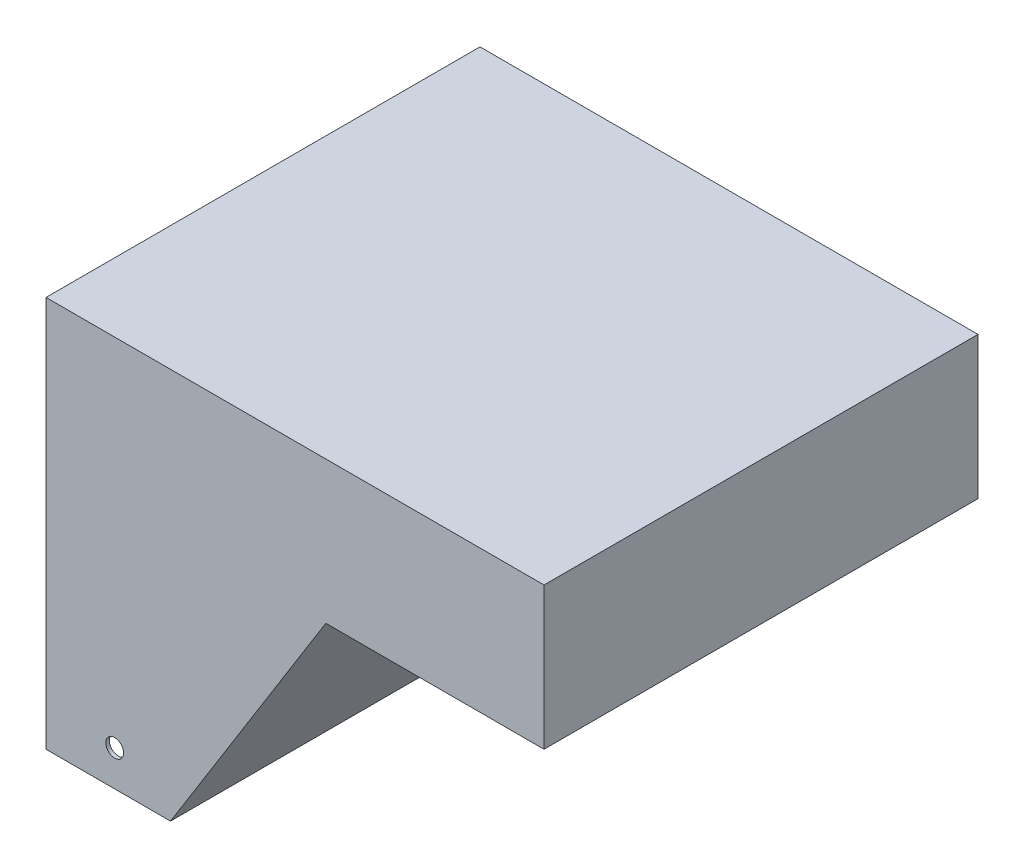
ISO-10303-21;
HEADER;
FILE_DESCRIPTION(('STEP AP214'),'2;1');
FILE_NAME('part.step','',(''),(''),'','','');
FILE_SCHEMA(('AUTOMOTIVE_DESIGN { 1 0 10303 214 1 1 1 1 }'));
ENDSEC;
DATA;
#1=APPLICATION_CONTEXT('core data for automotive mechanical design processes');
#2=APPLICATION_PROTOCOL_DEFINITION('international standard','automotive_design',2000,#1);
#3=PRODUCT_CONTEXT('',#1,'mechanical');
#4=PRODUCT('Part','Part','',(#3));
#5=PRODUCT_RELATED_PRODUCT_CATEGORY('part','',(#4));
#6=PRODUCT_DEFINITION_FORMATION('','',#4);
#7=PRODUCT_DEFINITION_CONTEXT('part definition',#1,'design');
#8=PRODUCT_DEFINITION('design','',#6,#7);
#9=PRODUCT_DEFINITION_SHAPE('','',#8);
#10=(LENGTH_UNIT() NAMED_UNIT(*) SI_UNIT(.MILLI.,.METRE.));
#11=(NAMED_UNIT(*) PLANE_ANGLE_UNIT() SI_UNIT($,.RADIAN.));
#12=(NAMED_UNIT(*) SI_UNIT($,.STERADIAN.) SOLID_ANGLE_UNIT());
#13=UNCERTAINTY_MEASURE_WITH_UNIT(LENGTH_MEASURE(1.E-05),#10,'distance_accuracy_value','');
#14=(GEOMETRIC_REPRESENTATION_CONTEXT(3) GLOBAL_UNCERTAINTY_ASSIGNED_CONTEXT((#13)) GLOBAL_UNIT_ASSIGNED_CONTEXT((#10,
#11,#12)) REPRESENTATION_CONTEXT('',''));
#15=CARTESIAN_POINT('',(0.,0.,0.));
#16=DIRECTION('',(0.,0.,1.));
#17=DIRECTION('',(1.,0.,0.));
#18=AXIS2_PLACEMENT_3D('',#15,#16,#17);
#19=CARTESIAN_POINT('',(0.,0.,2.54));
#20=DIRECTION('',(0.,0.,-1.));
#21=DIRECTION('',(-1.,0.,0.));
#22=AXIS2_PLACEMENT_3D('',#19,#20,#21);
#23=PLANE('',#22);
#24=DIRECTION('',(-1.,0.,0.));
#25=VECTOR('',#24,1.);
#26=CARTESIAN_POINT('',(0.,-2.54,2.54));
#27=LINE('',#26,#25);
#28=CARTESIAN_POINT('',(353.06,-2.54,2.54));
#29=VERTEX_POINT('',#28);
#30=CARTESIAN_POINT('',(2.54,-2.54,2.54));
#31=VERTEX_POINT('',#30);
#32=EDGE_CURVE('E53',#29,#31,#27,.T.);
#33=ORIENTED_EDGE('',*,*,#32,.T.);
#34=DIRECTION('',(0.,-1.,0.));
#35=VECTOR('',#34,1.);
#36=CARTESIAN_POINT('',(2.54,0.,2.54));
#37=LINE('',#36,#35);
#38=CARTESIAN_POINT('',(2.54,-279.4,2.54));
#39=VERTEX_POINT('',#38);
#40=EDGE_CURVE('E172',#31,#39,#37,.T.);
#41=ORIENTED_EDGE('',*,*,#40,.T.);
#42=DIRECTION('',(1.,0.,0.));
#43=VECTOR('',#42,1.);
#44=CARTESIAN_POINT('',(88.9,-279.4,2.54));
#45=LINE('',#44,#43);
#46=CARTESIAN_POINT('',(87.4907516063811,-279.4,2.54));
#47=VERTEX_POINT('',#46);
#48=EDGE_CURVE('E143',#39,#47,#45,.T.);
#49=ORIENTED_EDGE('',*,*,#48,.T.);
#50=DIRECTION('',(0.,-1.,0.));
#51=VECTOR('',#50,1.);
#52=CARTESIAN_POINT('',(87.4907516063811,0.,2.54));
#53=LINE('',#52,#51);
#54=CARTESIAN_POINT('',(87.4907516063811,-276.86,2.54));
#55=VERTEX_POINT('',#54);
#56=EDGE_CURVE('E197',#55,#47,#53,.T.);
#57=ORIENTED_EDGE('',*,*,#56,.F.);
#58=DIRECTION('',(0.529253460986314,0.848463772965003,0.));
#59=VECTOR('',#58,1.);
#60=CARTESIAN_POINT('',(187.30842913698,-116.838971269484,2.54));
#61=LINE('',#60,#59);
#62=CARTESIAN_POINT('',(198.398569195958,-99.06,2.54));
#63=VERTEX_POINT('',#62);
#64=EDGE_CURVE('E194',#55,#63,#61,.T.);
#65=ORIENTED_EDGE('',*,*,#64,.T.);
#66=DIRECTION('',(1.,0.,0.));
#67=VECTOR('',#66,1.);
#68=CARTESIAN_POINT('',(0.,-99.06,2.54));
#69=LINE('',#68,#67);
#70=CARTESIAN_POINT('',(353.06,-99.06,2.54));
#71=VERTEX_POINT('',#70);
#72=EDGE_CURVE('E191',#63,#71,#69,.T.);
#73=ORIENTED_EDGE('',*,*,#72,.T.);
#74=DIRECTION('',(0.,1.,0.));
#75=VECTOR('',#74,1.);
#76=CARTESIAN_POINT('',(353.06,0.,2.54));
#77=LINE('',#76,#75);
#78=EDGE_CURVE('E188',#71,#29,#77,.T.);
#79=ORIENTED_EDGE('',*,*,#78,.T.);
#80=EDGE_LOOP('',(#33,#41,#49,#57,#65,#73,#79));
#81=FACE_BOUND('',#80,.T.);
#82=CARTESIAN_POINT('',(49.0380508143322,-254.,2.54));
#83=DIRECTION('',(0.,0.,1.));
#84=DIRECTION('',(1.,0.,0.));
#85=AXIS2_PLACEMENT_3D('',#82,#83,#84);
#86=CIRCLE('',#85,6.35);
#87=CARTESIAN_POINT('',(55.3880508143322,-254.,2.54));
#88=VERTEX_POINT('',#87);
#89=EDGE_CURVE('E216',#88,#88,#86,.T.);
#90=ORIENTED_EDGE('',*,*,#89,.F.);
#91=EDGE_LOOP('',(#90));
#92=FACE_BOUND('',#91,.T.);
#93=ADVANCED_FACE('F38',(#81,#92),#23,.F.);
#94=CARTESIAN_POINT('',(0.,0.,0.));
#95=DIRECTION('',(0.,0.,-1.));
#96=DIRECTION('',(-1.,0.,0.));
#97=AXIS2_PLACEMENT_3D('',#94,#95,#96);
#98=PLANE('',#97);
#99=DIRECTION('',(0.,-1.,0.));
#100=VECTOR('',#99,1.);
#101=CARTESIAN_POINT('',(0.,-279.4,0.));
#102=LINE('',#101,#100);
#103=CARTESIAN_POINT('',(0.,0.,0.));
#104=VERTEX_POINT('',#103);
#105=CARTESIAN_POINT('',(0.,-279.4,0.));
#106=VERTEX_POINT('',#105);
#107=EDGE_CURVE('E219',#104,#106,#102,.T.);
#108=ORIENTED_EDGE('',*,*,#107,.F.);
#109=DIRECTION('',(-1.,0.,0.));
#110=VECTOR('',#109,1.);
#111=CARTESIAN_POINT('',(0.,0.,0.));
#112=LINE('',#111,#110);
#113=CARTESIAN_POINT('',(355.6,0.,0.));
#114=VERTEX_POINT('',#113);
#115=EDGE_CURVE('E61',#114,#104,#112,.T.);
#116=ORIENTED_EDGE('',*,*,#115,.F.);
#117=DIRECTION('',(0.,1.,0.));
#118=VECTOR('',#117,1.);
#119=CARTESIAN_POINT('',(355.6,0.,0.));
#120=LINE('',#119,#118);
#121=CARTESIAN_POINT('',(355.6,-101.6,0.));
#122=VERTEX_POINT('',#121);
#123=EDGE_CURVE('E231',#122,#114,#120,.T.);
#124=ORIENTED_EDGE('',*,*,#123,.F.);
#125=DIRECTION('',(1.,0.,0.));
#126=VECTOR('',#125,1.);
#127=CARTESIAN_POINT('',(355.6,-101.6,0.));
#128=LINE('',#127,#126);
#129=CARTESIAN_POINT('',(199.807817589577,-101.6,0.));
#130=VERTEX_POINT('',#129);
#131=EDGE_CURVE('E229',#130,#122,#128,.T.);
#132=ORIENTED_EDGE('',*,*,#131,.F.);
#133=DIRECTION('',(0.529253460986314,0.848463772965003,0.));
#134=VECTOR('',#133,1.);
#135=CARTESIAN_POINT('',(199.807817589577,-101.6,0.));
#136=LINE('',#135,#134);
#137=CARTESIAN_POINT('',(88.9,-279.4,0.));
#138=VERTEX_POINT('',#137);
#139=EDGE_CURVE('E227',#138,#130,#136,.T.);
#140=ORIENTED_EDGE('',*,*,#139,.F.);
#141=DIRECTION('',(1.,0.,0.));
#142=VECTOR('',#141,1.);
#143=CARTESIAN_POINT('',(88.9,-279.4,0.));
#144=LINE('',#143,#142);
#145=EDGE_CURVE('E225',#106,#138,#144,.T.);
#146=ORIENTED_EDGE('',*,*,#145,.F.);
#147=EDGE_LOOP('',(#108,#116,#124,#132,#140,#146));
#148=FACE_BOUND('',#147,.T.);
#149=CARTESIAN_POINT('',(49.0380508143322,-254.,0.));
#150=DIRECTION('',(0.,0.,1.));
#151=DIRECTION('',(1.,0.,0.));
#152=AXIS2_PLACEMENT_3D('',#149,#150,#151);
#153=CIRCLE('',#152,6.35);
#154=CARTESIAN_POINT('',(55.3880508143322,-254.,0.));
#155=VERTEX_POINT('',#154);
#156=EDGE_CURVE('E215',#155,#155,#153,.T.);
#157=ORIENTED_EDGE('',*,*,#156,.T.);
#158=EDGE_LOOP('',(#157));
#159=FACE_BOUND('',#158,.T.);
#160=ADVANCED_FACE('F248',(#148,#159),#98,.T.);
#161=CARTESIAN_POINT('',(0.,-279.4,2.54));
#162=DIRECTION('',(1.,0.,0.));
#163=DIRECTION('',(0.,0.,-1.));
#164=AXIS2_PLACEMENT_3D('',#161,#162,#163);
#165=PLANE('',#164);
#166=ORIENTED_EDGE('',*,*,#107,.T.);
#167=DIRECTION('',(0.,0.,-1.));
#168=VECTOR('',#167,1.);
#169=CARTESIAN_POINT('',(0.,-279.4,2.54));
#170=LINE('',#169,#168);
#171=CARTESIAN_POINT('',(0.,-279.4,309.88));
#172=VERTEX_POINT('',#171);
#173=EDGE_CURVE('E11',#172,#106,#170,.T.);
#174=ORIENTED_EDGE('',*,*,#173,.F.);
#175=DIRECTION('',(0.,-1.,0.));
#176=VECTOR('',#175,1.);
#177=CARTESIAN_POINT('',(0.,-279.4,309.88));
#178=LINE('',#177,#176);
#179=CARTESIAN_POINT('',(0.,0.,309.88));
#180=VERTEX_POINT('',#179);
#181=EDGE_CURVE('E146',#180,#172,#178,.T.);
#182=ORIENTED_EDGE('',*,*,#181,.F.);
#183=DIRECTION('',(0.,0.,-1.));
#184=VECTOR('',#183,1.);
#185=CARTESIAN_POINT('',(0.,0.,2.54));
#186=LINE('',#185,#184);
#187=EDGE_CURVE('E133',#180,#104,#186,.T.);
#188=ORIENTED_EDGE('',*,*,#187,.T.);
#189=EDGE_LOOP('',(#166,#174,#182,#188));
#190=FACE_BOUND('',#189,.T.);
#191=ADVANCED_FACE('F40',(#190),#165,.F.);
#192=CARTESIAN_POINT('',(88.9,-279.4,2.54));
#193=DIRECTION('',(0.,1.,0.));
#194=DIRECTION('',(0.,0.,1.));
#195=AXIS2_PLACEMENT_3D('',#192,#193,#194);
#196=PLANE('',#195);
#197=DIRECTION('',(0.,0.,-1.));
#198=VECTOR('',#197,1.);
#199=CARTESIAN_POINT('',(88.9,-279.4,2.54));
#200=LINE('',#199,#198);
#201=CARTESIAN_POINT('',(88.9,-279.4,309.88));
#202=VERTEX_POINT('',#201);
#203=EDGE_CURVE('E46',#202,#138,#200,.T.);
#204=ORIENTED_EDGE('',*,*,#203,.F.);
#205=DIRECTION('',(1.,0.,0.));
#206=VECTOR('',#205,1.);
#207=CARTESIAN_POINT('',(88.9,-279.4,309.88));
#208=LINE('',#207,#206);
#209=EDGE_CURVE('E165',#172,#202,#208,.T.);
#210=ORIENTED_EDGE('',*,*,#209,.F.);
#211=ORIENTED_EDGE('',*,*,#173,.T.);
#212=ORIENTED_EDGE('',*,*,#145,.T.);
#213=EDGE_LOOP('',(#204,#210,#211,#212));
#214=FACE_BOUND('',#213,.T.);
#215=DIRECTION('',(1.,0.,0.));
#216=VECTOR('',#215,1.);
#217=CARTESIAN_POINT('',(88.9,-279.4,307.34));
#218=LINE('',#217,#216);
#219=CARTESIAN_POINT('',(2.54,-279.4,307.34));
#220=VERTEX_POINT('',#219);
#221=CARTESIAN_POINT('',(87.4907516063811,-279.4,307.34));
#222=VERTEX_POINT('',#221);
#223=EDGE_CURVE('E167',#220,#222,#218,.T.);
#224=ORIENTED_EDGE('',*,*,#223,.T.);
#225=DIRECTION('',(0.,0.,-1.));
#226=VECTOR('',#225,1.);
#227=CARTESIAN_POINT('',(87.4907516063811,-279.4,307.34));
#228=LINE('',#227,#226);
#229=EDGE_CURVE('E204',#222,#47,#228,.T.);
#230=ORIENTED_EDGE('',*,*,#229,.T.);
#231=ORIENTED_EDGE('',*,*,#48,.F.);
#232=DIRECTION('',(0.,0.,-1.));
#233=VECTOR('',#232,1.);
#234=CARTESIAN_POINT('',(2.54,-279.4,307.34));
#235=LINE('',#234,#233);
#236=EDGE_CURVE('E202',#220,#39,#235,.T.);
#237=ORIENTED_EDGE('',*,*,#236,.F.);
#238=EDGE_LOOP('',(#224,#230,#231,#237));
#239=FACE_BOUND('',#238,.T.);
#240=ADVANCED_FACE('F256',(#214,#239),#196,.F.);
#241=CARTESIAN_POINT('',(199.807817589577,-101.6,2.54));
#242=DIRECTION('',(-0.848463772965003,0.529253460986314,0.));
#243=DIRECTION('',(-0.529253460986314,-0.848463772965003,0.));
#244=AXIS2_PLACEMENT_3D('',#241,#242,#243);
#245=PLANE('',#244);
#246=ORIENTED_EDGE('',*,*,#139,.T.);
#247=DIRECTION('',(0.,0.,-1.));
#248=VECTOR('',#247,1.);
#249=CARTESIAN_POINT('',(199.807817589577,-101.6,2.54));
#250=LINE('',#249,#248);
#251=CARTESIAN_POINT('',(199.807817589577,-101.6,309.88));
#252=VERTEX_POINT('',#251);
#253=EDGE_CURVE('E238',#252,#130,#250,.T.);
#254=ORIENTED_EDGE('',*,*,#253,.F.);
#255=DIRECTION('',(0.529253460986314,0.848463772965003,0.));
#256=VECTOR('',#255,1.);
#257=CARTESIAN_POINT('',(199.807817589577,-101.6,309.88));
#258=LINE('',#257,#256);
#259=EDGE_CURVE('E162',#202,#252,#258,.T.);
#260=ORIENTED_EDGE('',*,*,#259,.F.);
#261=ORIENTED_EDGE('',*,*,#203,.T.);
#262=EDGE_LOOP('',(#246,#254,#260,#261));
#263=FACE_BOUND('',#262,.T.);
#264=ADVANCED_FACE('F244',(#263),#245,.F.);
#265=CARTESIAN_POINT('',(355.6,-101.6,2.54));
#266=DIRECTION('',(0.,1.,0.));
#267=DIRECTION('',(0.,0.,1.));
#268=AXIS2_PLACEMENT_3D('',#265,#266,#267);
#269=PLANE('',#268);
#270=ORIENTED_EDGE('',*,*,#131,.T.);
#271=DIRECTION('',(0.,0.,-1.));
#272=VECTOR('',#271,1.);
#273=CARTESIAN_POINT('',(355.6,-101.6,2.54));
#274=LINE('',#273,#272);
#275=CARTESIAN_POINT('',(355.6,-101.6,309.88));
#276=VERTEX_POINT('',#275);
#277=EDGE_CURVE('E235',#276,#122,#274,.T.);
#278=ORIENTED_EDGE('',*,*,#277,.F.);
#279=DIRECTION('',(1.,0.,0.));
#280=VECTOR('',#279,1.);
#281=CARTESIAN_POINT('',(355.6,-101.6,309.88));
#282=LINE('',#281,#280);
#283=EDGE_CURVE('E157',#252,#276,#282,.T.);
#284=ORIENTED_EDGE('',*,*,#283,.F.);
#285=ORIENTED_EDGE('',*,*,#253,.T.);
#286=EDGE_LOOP('',(#270,#278,#284,#285));
#287=FACE_BOUND('',#286,.T.);
#288=ADVANCED_FACE('F252',(#287),#269,.F.);
#289=CARTESIAN_POINT('',(355.6,0.,2.54));
#290=DIRECTION('',(-1.,0.,0.));
#291=DIRECTION('',(0.,0.,1.));
#292=AXIS2_PLACEMENT_3D('',#289,#290,#291);
#293=PLANE('',#292);
#294=ORIENTED_EDGE('',*,*,#123,.T.);
#295=DIRECTION('',(0.,0.,-1.));
#296=VECTOR('',#295,1.);
#297=CARTESIAN_POINT('',(355.6,0.,2.54));
#298=LINE('',#297,#296);
#299=CARTESIAN_POINT('',(355.6,0.,309.88));
#300=VERTEX_POINT('',#299);
#301=EDGE_CURVE('E142',#300,#114,#298,.T.);
#302=ORIENTED_EDGE('',*,*,#301,.F.);
#303=DIRECTION('',(0.,1.,0.));
#304=VECTOR('',#303,1.);
#305=CARTESIAN_POINT('',(355.6,0.,309.88));
#306=LINE('',#305,#304);
#307=EDGE_CURVE('E155',#276,#300,#306,.T.);
#308=ORIENTED_EDGE('',*,*,#307,.F.);
#309=ORIENTED_EDGE('',*,*,#277,.T.);
#310=EDGE_LOOP('',(#294,#302,#308,#309));
#311=FACE_BOUND('',#310,.T.);
#312=ADVANCED_FACE('F255',(#311),#293,.F.);
#313=CARTESIAN_POINT('',(0.,0.,2.54));
#314=DIRECTION('',(0.,-1.,0.));
#315=DIRECTION('',(0.,0.,-1.));
#316=AXIS2_PLACEMENT_3D('',#313,#314,#315);
#317=PLANE('',#316);
#318=ORIENTED_EDGE('',*,*,#115,.T.);
#319=ORIENTED_EDGE('',*,*,#187,.F.);
#320=DIRECTION('',(-1.,0.,0.));
#321=VECTOR('',#320,1.);
#322=CARTESIAN_POINT('',(0.,0.,309.88));
#323=LINE('',#322,#321);
#324=EDGE_CURVE('E137',#300,#180,#323,.T.);
#325=ORIENTED_EDGE('',*,*,#324,.F.);
#326=ORIENTED_EDGE('',*,*,#301,.T.);
#327=EDGE_LOOP('',(#318,#319,#325,#326));
#328=FACE_BOUND('',#327,.T.);
#329=ADVANCED_FACE('F135',(#328),#317,.F.);
#330=CARTESIAN_POINT('',(49.0380508143322,-254.,2.54));
#331=DIRECTION('',(0.,0.,-1.));
#332=DIRECTION('',(-1.,0.,0.));
#333=AXIS2_PLACEMENT_3D('',#330,#331,#332);
#334=CYLINDRICAL_SURFACE('',#333,6.35);
#335=ORIENTED_EDGE('',*,*,#89,.T.);
#336=EDGE_LOOP('',(#335));
#337=FACE_BOUND('',#336,.T.);
#338=ORIENTED_EDGE('',*,*,#156,.F.);
#339=EDGE_LOOP('',(#338));
#340=FACE_BOUND('',#339,.T.);
#341=ADVANCED_FACE('F303',(#337,#340),#334,.F.);
#342=CARTESIAN_POINT('',(0.,-2.54,307.34));
#343=DIRECTION('',(0.,-1.,0.));
#344=DIRECTION('',(0.,0.,-1.));
#345=AXIS2_PLACEMENT_3D('',#342,#343,#344);
#346=PLANE('',#345);
#347=ORIENTED_EDGE('',*,*,#32,.F.);
#348=DIRECTION('',(0.,0.,-1.));
#349=VECTOR('',#348,1.);
#350=CARTESIAN_POINT('',(353.06,-2.54,307.34));
#351=LINE('',#350,#349);
#352=CARTESIAN_POINT('',(353.06,-2.54,307.34));
#353=VERTEX_POINT('',#352);
#354=EDGE_CURVE('E213',#353,#29,#351,.T.);
#355=ORIENTED_EDGE('',*,*,#354,.F.);
#356=DIRECTION('',(-1.,0.,0.));
#357=VECTOR('',#356,1.);
#358=CARTESIAN_POINT('',(0.,-2.54,307.34));
#359=LINE('',#358,#357);
#360=CARTESIAN_POINT('',(2.54,-2.54,307.34));
#361=VERTEX_POINT('',#360);
#362=EDGE_CURVE('E168',#353,#361,#359,.T.);
#363=ORIENTED_EDGE('',*,*,#362,.T.);
#364=DIRECTION('',(0.,0.,-1.));
#365=VECTOR('',#364,1.);
#366=CARTESIAN_POINT('',(2.54,-2.54,307.34));
#367=LINE('',#366,#365);
#368=EDGE_CURVE('E186',#361,#31,#367,.T.);
#369=ORIENTED_EDGE('',*,*,#368,.T.);
#370=EDGE_LOOP('',(#347,#355,#363,#369));
#371=FACE_BOUND('',#370,.T.);
#372=ADVANCED_FACE('F278',(#371),#346,.T.);
#373=CARTESIAN_POINT('',(353.06,0.,307.34));
#374=DIRECTION('',(-1.,0.,0.));
#375=DIRECTION('',(0.,0.,1.));
#376=AXIS2_PLACEMENT_3D('',#373,#374,#375);
#377=PLANE('',#376);
#378=ORIENTED_EDGE('',*,*,#78,.F.);
#379=DIRECTION('',(0.,0.,-1.));
#380=VECTOR('',#379,1.);
#381=CARTESIAN_POINT('',(353.06,-99.06,307.34));
#382=LINE('',#381,#380);
#383=CARTESIAN_POINT('',(353.06,-99.06,307.34));
#384=VERTEX_POINT('',#383);
#385=EDGE_CURVE('E211',#384,#71,#382,.T.);
#386=ORIENTED_EDGE('',*,*,#385,.F.);
#387=DIRECTION('',(0.,1.,0.));
#388=VECTOR('',#387,1.);
#389=CARTESIAN_POINT('',(353.06,0.,307.34));
#390=LINE('',#389,#388);
#391=EDGE_CURVE('E171',#384,#353,#390,.T.);
#392=ORIENTED_EDGE('',*,*,#391,.T.);
#393=ORIENTED_EDGE('',*,*,#354,.T.);
#394=EDGE_LOOP('',(#378,#386,#392,#393));
#395=FACE_BOUND('',#394,.T.);
#396=ADVANCED_FACE('F281',(#395),#377,.T.);
#397=CARTESIAN_POINT('',(0.,-99.06,307.34));
#398=DIRECTION('',(0.,1.,0.));
#399=DIRECTION('',(0.,0.,1.));
#400=AXIS2_PLACEMENT_3D('',#397,#398,#399);
#401=PLANE('',#400);
#402=ORIENTED_EDGE('',*,*,#72,.F.);
#403=DIRECTION('',(0.,0.,-1.));
#404=VECTOR('',#403,1.);
#405=CARTESIAN_POINT('',(198.398569195958,-99.06,307.34));
#406=LINE('',#405,#404);
#407=CARTESIAN_POINT('',(198.398569195958,-99.06,307.34));
#408=VERTEX_POINT('',#407);
#409=EDGE_CURVE('E209',#408,#63,#406,.T.);
#410=ORIENTED_EDGE('',*,*,#409,.F.);
#411=DIRECTION('',(1.,0.,0.));
#412=VECTOR('',#411,1.);
#413=CARTESIAN_POINT('',(0.,-99.06,307.34));
#414=LINE('',#413,#412);
#415=EDGE_CURVE('E175',#408,#384,#414,.T.);
#416=ORIENTED_EDGE('',*,*,#415,.T.);
#417=ORIENTED_EDGE('',*,*,#385,.T.);
#418=EDGE_LOOP('',(#402,#410,#416,#417));
#419=FACE_BOUND('',#418,.T.);
#420=ADVANCED_FACE('F285',(#419),#401,.T.);
#421=CARTESIAN_POINT('',(187.30842913698,-116.838971269484,307.34));
#422=DIRECTION('',(-0.848463772965003,0.529253460986313,0.));
#423=DIRECTION('',(-0.529253460986314,-0.848463772965004,0.));
#424=AXIS2_PLACEMENT_3D('',#421,#422,#423);
#425=PLANE('',#424);
#426=ORIENTED_EDGE('',*,*,#64,.F.);
#427=DIRECTION('',(0.,0.,-1.));
#428=VECTOR('',#427,1.);
#429=CARTESIAN_POINT('',(87.4907516063811,-276.86,307.34));
#430=LINE('',#429,#428);
#431=CARTESIAN_POINT('',(87.4907516063811,-276.86,307.34));
#432=VERTEX_POINT('',#431);
#433=EDGE_CURVE('E207',#432,#55,#430,.T.);
#434=ORIENTED_EDGE('',*,*,#433,.F.);
#435=DIRECTION('',(0.529253460986314,0.848463772965003,0.));
#436=VECTOR('',#435,1.);
#437=CARTESIAN_POINT('',(187.30842913698,-116.838971269484,307.34));
#438=LINE('',#437,#436);
#439=EDGE_CURVE('E178',#432,#408,#438,.T.);
#440=ORIENTED_EDGE('',*,*,#439,.T.);
#441=ORIENTED_EDGE('',*,*,#409,.T.);
#442=EDGE_LOOP('',(#426,#434,#440,#441));
#443=FACE_BOUND('',#442,.T.);
#444=ADVANCED_FACE('F287',(#443),#425,.T.);
#445=CARTESIAN_POINT('',(87.4907516063811,0.,307.34));
#446=DIRECTION('',(1.,0.,0.));
#447=DIRECTION('',(0.,0.,-1.));
#448=AXIS2_PLACEMENT_3D('',#445,#446,#447);
#449=PLANE('',#448);
#450=ORIENTED_EDGE('',*,*,#56,.T.);
#451=ORIENTED_EDGE('',*,*,#229,.F.);
#452=DIRECTION('',(0.,-1.,0.));
#453=VECTOR('',#452,1.);
#454=CARTESIAN_POINT('',(87.4907516063811,0.,307.34));
#455=LINE('',#454,#453);
#456=EDGE_CURVE('E181',#432,#222,#455,.T.);
#457=ORIENTED_EDGE('',*,*,#456,.F.);
#458=ORIENTED_EDGE('',*,*,#433,.T.);
#459=EDGE_LOOP('',(#450,#451,#457,#458));
#460=FACE_BOUND('',#459,.T.);
#461=ADVANCED_FACE('F266',(#460),#449,.F.);
#462=CARTESIAN_POINT('',(2.54,0.,307.34));
#463=DIRECTION('',(1.,0.,0.));
#464=DIRECTION('',(0.,0.,-1.));
#465=AXIS2_PLACEMENT_3D('',#462,#463,#464);
#466=PLANE('',#465);
#467=ORIENTED_EDGE('',*,*,#40,.F.);
#468=ORIENTED_EDGE('',*,*,#368,.F.);
#469=DIRECTION('',(0.,-1.,0.));
#470=VECTOR('',#469,1.);
#471=CARTESIAN_POINT('',(2.54,0.,307.34));
#472=LINE('',#471,#470);
#473=EDGE_CURVE('E183',#361,#220,#472,.T.);
#474=ORIENTED_EDGE('',*,*,#473,.T.);
#475=ORIENTED_EDGE('',*,*,#236,.T.);
#476=EDGE_LOOP('',(#467,#468,#474,#475));
#477=FACE_BOUND('',#476,.T.);
#478=ADVANCED_FACE('F275',(#477),#466,.T.);
#479=CARTESIAN_POINT('',(0.,0.,307.34));
#480=DIRECTION('',(0.,0.,1.));
#481=DIRECTION('',(-1.,0.,0.));
#482=AXIS2_PLACEMENT_3D('',#479,#480,#481);
#483=PLANE('',#482);
#484=CARTESIAN_POINT('',(49.0380508143322,-254.,307.34));
#485=DIRECTION('',(0.,0.,1.));
#486=DIRECTION('',(1.,0.,0.));
#487=AXIS2_PLACEMENT_3D('',#484,#485,#486);
#488=CIRCLE('',#487,6.35);
#489=CARTESIAN_POINT('',(55.3880508143322,-254.,307.34));
#490=VERTEX_POINT('',#489);
#491=EDGE_CURVE('E150',#490,#490,#488,.T.);
#492=ORIENTED_EDGE('',*,*,#491,.T.);
#493=EDGE_LOOP('',(#492));
#494=FACE_BOUND('',#493,.T.);
#495=ORIENTED_EDGE('',*,*,#439,.F.);
#496=ORIENTED_EDGE('',*,*,#456,.T.);
#497=ORIENTED_EDGE('',*,*,#223,.F.);
#498=ORIENTED_EDGE('',*,*,#473,.F.);
#499=ORIENTED_EDGE('',*,*,#362,.F.);
#500=ORIENTED_EDGE('',*,*,#391,.F.);
#501=ORIENTED_EDGE('',*,*,#415,.F.);
#502=EDGE_LOOP('',(#495,#496,#497,#498,#499,#500,#501));
#503=FACE_BOUND('',#502,.T.);
#504=ADVANCED_FACE('F276',(#494,#503),#483,.F.);
#505=CARTESIAN_POINT('',(0.,0.,309.88));
#506=DIRECTION('',(0.,0.,1.));
#507=DIRECTION('',(-1.,0.,0.));
#508=AXIS2_PLACEMENT_3D('',#505,#506,#507);
#509=PLANE('',#508);
#510=CARTESIAN_POINT('',(49.0380508143322,-254.,309.88));
#511=DIRECTION('',(0.,0.,1.));
#512=DIRECTION('',(1.,0.,0.));
#513=AXIS2_PLACEMENT_3D('',#510,#511,#512);
#514=CIRCLE('',#513,6.35);
#515=CARTESIAN_POINT('',(55.3880508143322,-254.,309.88));
#516=VERTEX_POINT('',#515);
#517=EDGE_CURVE('E518',#516,#516,#514,.T.);
#518=ORIENTED_EDGE('',*,*,#517,.F.);
#519=EDGE_LOOP('',(#518));
#520=FACE_BOUND('',#519,.T.);
#521=ORIENTED_EDGE('',*,*,#181,.T.);
#522=ORIENTED_EDGE('',*,*,#209,.T.);
#523=ORIENTED_EDGE('',*,*,#259,.T.);
#524=ORIENTED_EDGE('',*,*,#283,.T.);
#525=ORIENTED_EDGE('',*,*,#307,.T.);
#526=ORIENTED_EDGE('',*,*,#324,.T.);
#527=EDGE_LOOP('',(#521,#522,#523,#524,#525,#526));
#528=FACE_BOUND('',#527,.T.);
#529=ADVANCED_FACE('F152',(#520,#528),#509,.T.);
#530=CARTESIAN_POINT('',(49.0380508143322,-254.,307.34));
#531=DIRECTION('',(0.,0.,1.));
#532=DIRECTION('',(1.,0.,0.));
#533=AXIS2_PLACEMENT_3D('',#530,#531,#532);
#534=CYLINDRICAL_SURFACE('',#533,6.35);
#535=ORIENTED_EDGE('',*,*,#491,.F.);
#536=EDGE_LOOP('',(#535));
#537=FACE_BOUND('',#536,.T.);
#538=ORIENTED_EDGE('',*,*,#517,.T.);
#539=EDGE_LOOP('',(#538));
#540=FACE_BOUND('',#539,.T.);
#541=ADVANCED_FACE('F394',(#537,#540),#534,.F.);
#542=CLOSED_SHELL('',(#93,#160,#191,#240,#264,#288,#312,#329,#341,#372,#396,#420,#444,#461,#478,
#504,#529,#541));
#543=MANIFOLD_SOLID_BREP('B2',#542);
#544=ADVANCED_BREP_SHAPE_REPRESENTATION('',(#18,#543),#14);
#545=SHAPE_DEFINITION_REPRESENTATION(#9,#544);
ENDSEC;
END-ISO-10303-21;
